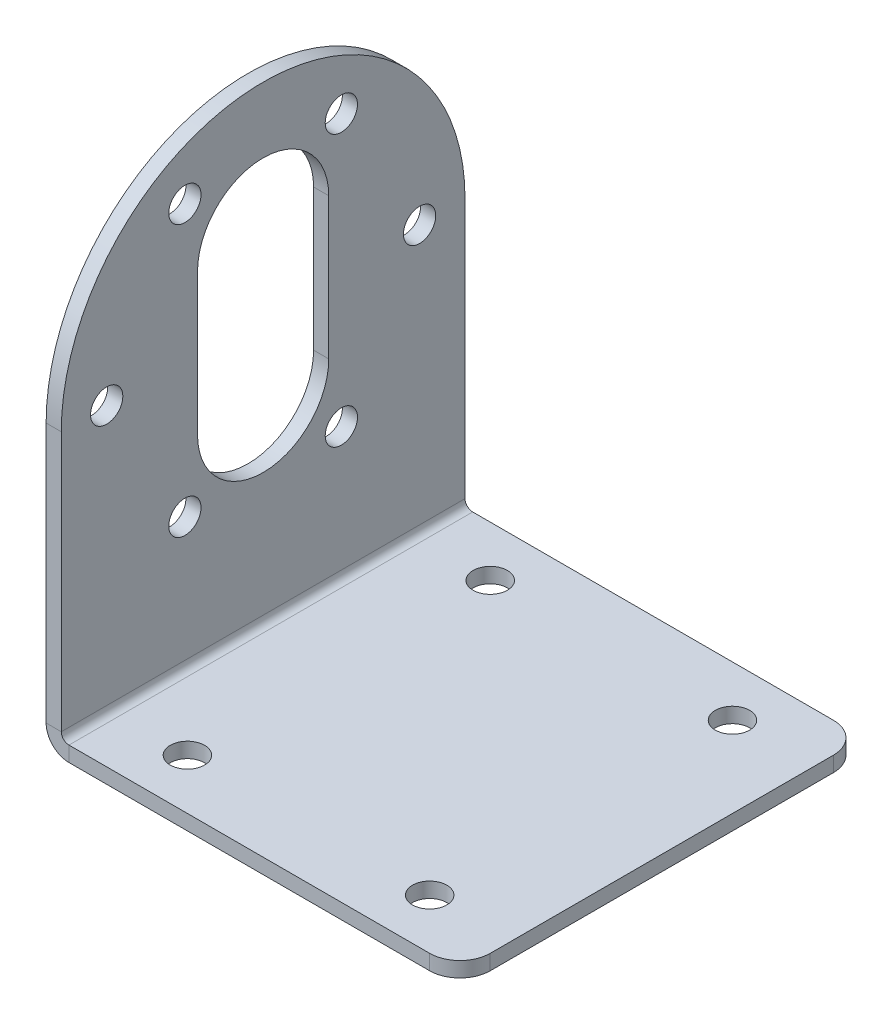
ISO-10303-21;
HEADER;
FILE_DESCRIPTION(('STEP AP214'),'2;1');
FILE_NAME('part.step','',(''),(''),'','','');
FILE_SCHEMA(('AUTOMOTIVE_DESIGN { 1 0 10303 214 1 1 1 1 }'));
ENDSEC;
DATA;
#1=APPLICATION_CONTEXT('core data for automotive mechanical design processes');
#2=APPLICATION_PROTOCOL_DEFINITION('international standard','automotive_design',2000,#1);
#3=PRODUCT_CONTEXT('',#1,'mechanical');
#4=PRODUCT('Part','Part','',(#3));
#5=PRODUCT_RELATED_PRODUCT_CATEGORY('part','',(#4));
#6=PRODUCT_DEFINITION_FORMATION('','',#4);
#7=PRODUCT_DEFINITION_CONTEXT('part definition',#1,'design');
#8=PRODUCT_DEFINITION('design','',#6,#7);
#9=PRODUCT_DEFINITION_SHAPE('','',#8);
#10=(LENGTH_UNIT() NAMED_UNIT(*) SI_UNIT(.MILLI.,.METRE.));
#11=(NAMED_UNIT(*) PLANE_ANGLE_UNIT() SI_UNIT($,.RADIAN.));
#12=(NAMED_UNIT(*) SI_UNIT($,.STERADIAN.) SOLID_ANGLE_UNIT());
#13=UNCERTAINTY_MEASURE_WITH_UNIT(LENGTH_MEASURE(1.E-05),#10,'distance_accuracy_value','');
#14=(GEOMETRIC_REPRESENTATION_CONTEXT(3) GLOBAL_UNCERTAINTY_ASSIGNED_CONTEXT((#13)) GLOBAL_UNIT_ASSIGNED_CONTEXT((#10,
#11,#12)) REPRESENTATION_CONTEXT('',''));
#15=CARTESIAN_POINT('',(0.,0.,0.));
#16=DIRECTION('',(0.,0.,1.));
#17=DIRECTION('',(1.,0.,0.));
#18=AXIS2_PLACEMENT_3D('',#15,#16,#17);
#19=CARTESIAN_POINT('',(0.,0.,0.));
#20=DIRECTION('',(1.,0.,0.));
#21=DIRECTION('',(0.,0.,-1.));
#22=AXIS2_PLACEMENT_3D('',#19,#20,#21);
#23=PLANE('',#22);
#24=DIRECTION('',(0.,-1.,0.));
#25=VECTOR('',#24,1.);
#26=CARTESIAN_POINT('',(0.,7.,-6.5));
#27=LINE('',#26,#25);
#28=CARTESIAN_POINT('',(0.,7.,-6.5));
#29=VERTEX_POINT('',#28);
#30=CARTESIAN_POINT('',(0.,-7.,-6.5));
#31=VERTEX_POINT('',#30);
#32=EDGE_CURVE('E156',#29,#31,#27,.T.);
#33=ORIENTED_EDGE('',*,*,#32,.F.);
#34=CARTESIAN_POINT('',(0.,7.,0.));
#35=DIRECTION('',(-1.,0.,0.));
#36=DIRECTION('',(0.,0.,1.));
#37=AXIS2_PLACEMENT_3D('',#34,#35,#36);
#38=CIRCLE('',#37,6.5);
#39=CARTESIAN_POINT('',(0.,7.,6.5));
#40=VERTEX_POINT('',#39);
#41=EDGE_CURVE('E161',#40,#29,#38,.T.);
#42=ORIENTED_EDGE('',*,*,#41,.F.);
#43=DIRECTION('',(0.,1.,0.));
#44=VECTOR('',#43,1.);
#45=CARTESIAN_POINT('',(0.,7.,6.5));
#46=LINE('',#45,#44);
#47=CARTESIAN_POINT('',(0.,-7.,6.5));
#48=VERTEX_POINT('',#47);
#49=EDGE_CURVE('E165',#48,#40,#46,.T.);
#50=ORIENTED_EDGE('',*,*,#49,.F.);
#51=CARTESIAN_POINT('',(0.,-7.,0.));
#52=DIRECTION('',(-1.,0.,0.));
#53=DIRECTION('',(0.,0.,1.));
#54=AXIS2_PLACEMENT_3D('',#51,#52,#53);
#55=CIRCLE('',#54,6.5);
#56=EDGE_CURVE('E145',#31,#48,#55,.T.);
#57=ORIENTED_EDGE('',*,*,#56,.F.);
#58=EDGE_LOOP('',(#33,#42,#50,#57));
#59=FACE_BOUND('',#58,.T.);
#60=CARTESIAN_POINT('',(0.,-13.4233937586589,7.74999999999988));
#61=DIRECTION('',(-1.,0.,0.));
#62=DIRECTION('',(0.,0.,1.));
#63=AXIS2_PLACEMENT_3D('',#60,#61,#62);
#64=CIRCLE('',#63,1.6);
#65=CARTESIAN_POINT('',(0.,-13.4233937586589,9.34999999999988));
#66=VERTEX_POINT('',#65);
#67=EDGE_CURVE('E180',#66,#66,#64,.T.);
#68=ORIENTED_EDGE('',*,*,#67,.F.);
#69=EDGE_LOOP('',(#68));
#70=FACE_BOUND('',#69,.T.);
#71=CARTESIAN_POINT('',(0.,13.4233937586588,7.75000000000006));
#72=DIRECTION('',(-1.,0.,0.));
#73=DIRECTION('',(0.,0.,1.));
#74=AXIS2_PLACEMENT_3D('',#71,#72,#73);
#75=CIRCLE('',#74,1.6);
#76=CARTESIAN_POINT('',(0.,13.4233937586588,9.35000000000006));
#77=VERTEX_POINT('',#76);
#78=EDGE_CURVE('E192',#77,#77,#75,.T.);
#79=ORIENTED_EDGE('',*,*,#78,.F.);
#80=EDGE_LOOP('',(#79));
#81=FACE_BOUND('',#80,.T.);
#82=CARTESIAN_POINT('',(0.,13.4233937586588,-7.74999999999997));
#83=DIRECTION('',(-1.,0.,0.));
#84=DIRECTION('',(0.,0.,1.));
#85=AXIS2_PLACEMENT_3D('',#82,#83,#84);
#86=CIRCLE('',#85,1.6);
#87=CARTESIAN_POINT('',(0.,13.4233937586588,-6.14999999999997));
#88=VERTEX_POINT('',#87);
#89=EDGE_CURVE('E198',#88,#88,#86,.T.);
#90=ORIENTED_EDGE('',*,*,#89,.F.);
#91=EDGE_LOOP('',(#90));
#92=FACE_BOUND('',#91,.T.);
#93=CARTESIAN_POINT('',(0.,0.,-15.5));
#94=DIRECTION('',(-1.,0.,0.));
#95=DIRECTION('',(0.,0.,1.));
#96=AXIS2_PLACEMENT_3D('',#93,#94,#95);
#97=CIRCLE('',#96,1.6);
#98=CARTESIAN_POINT('',(0.,0.,-13.9));
#99=VERTEX_POINT('',#98);
#100=EDGE_CURVE('E202',#99,#99,#97,.T.);
#101=ORIENTED_EDGE('',*,*,#100,.F.);
#102=EDGE_LOOP('',(#101));
#103=FACE_BOUND('',#102,.T.);
#104=DIRECTION('',(0.,1.,0.));
#105=VECTOR('',#104,1.);
#106=CARTESIAN_POINT('',(0.,0.,-20.));
#107=LINE('',#106,#105);
#108=CARTESIAN_POINT('',(0.,-25.738,-20.));
#109=VERTEX_POINT('',#108);
#110=CARTESIAN_POINT('',(0.,0.,-20.));
#111=VERTEX_POINT('',#110);
#112=EDGE_CURVE('E223',#109,#111,#107,.T.);
#113=ORIENTED_EDGE('',*,*,#112,.F.);
#114=DIRECTION('',(0.,0.,-1.));
#115=VECTOR('',#114,1.);
#116=CARTESIAN_POINT('',(0.,-25.738,0.));
#117=LINE('',#116,#115);
#118=CARTESIAN_POINT('',(0.,-25.738,20.));
#119=VERTEX_POINT('',#118);
#120=EDGE_CURVE('E229',#109,#119,#117,.F.);
#121=ORIENTED_EDGE('',*,*,#120,.T.);
#122=DIRECTION('',(0.,-1.,0.));
#123=VECTOR('',#122,1.);
#124=CARTESIAN_POINT('',(0.,0.,20.));
#125=LINE('',#124,#123);
#126=CARTESIAN_POINT('',(0.,0.,20.));
#127=VERTEX_POINT('',#126);
#128=EDGE_CURVE('E217',#127,#119,#125,.T.);
#129=ORIENTED_EDGE('',*,*,#128,.F.);
#130=CARTESIAN_POINT('',(0.,0.,0.));
#131=DIRECTION('',(1.,0.,0.));
#132=DIRECTION('',(0.,0.,-1.));
#133=AXIS2_PLACEMENT_3D('',#130,#131,#132);
#134=CIRCLE('',#133,20.);
#135=EDGE_CURVE('E220',#111,#127,#134,.T.);
#136=ORIENTED_EDGE('',*,*,#135,.F.);
#137=EDGE_LOOP('',(#113,#121,#129,#136));
#138=FACE_BOUND('',#137,.T.);
#139=CARTESIAN_POINT('',(0.,0.,15.5));
#140=DIRECTION('',(-1.,0.,0.));
#141=DIRECTION('',(0.,0.,1.));
#142=AXIS2_PLACEMENT_3D('',#139,#140,#141);
#143=CIRCLE('',#142,1.6);
#144=CARTESIAN_POINT('',(0.,0.,17.1));
#145=VERTEX_POINT('',#144);
#146=EDGE_CURVE('E186',#145,#145,#143,.T.);
#147=ORIENTED_EDGE('',*,*,#146,.F.);
#148=EDGE_LOOP('',(#147));
#149=FACE_BOUND('',#148,.T.);
#150=CARTESIAN_POINT('',(0.,-13.4233937586587,-7.75000000000016));
#151=DIRECTION('',(-1.,0.,0.));
#152=DIRECTION('',(0.,0.,1.));
#153=AXIS2_PLACEMENT_3D('',#150,#151,#152);
#154=CIRCLE('',#153,1.6);
#155=CARTESIAN_POINT('',(0.,-13.4233937586587,-6.15000000000016));
#156=VERTEX_POINT('',#155);
#157=EDGE_CURVE('E172',#156,#156,#154,.T.);
#158=ORIENTED_EDGE('',*,*,#157,.F.);
#159=EDGE_LOOP('',(#158));
#160=FACE_BOUND('',#159,.T.);
#161=ADVANCED_FACE('F39',(#59,#70,#81,#92,#103,#138,#149,#160),#23,.F.);
#162=CARTESIAN_POINT('',(1.5,-28.,-20.));
#163=DIRECTION('',(0.,0.,-1.));
#164=DIRECTION('',(-1.,0.,0.));
#165=AXIS2_PLACEMENT_3D('',#162,#163,#164);
#166=PLANE('',#165);
#167=DIRECTION('',(1.,0.,0.));
#168=VECTOR('',#167,1.);
#169=CARTESIAN_POINT('',(1.5,-26.5,-20.));
#170=LINE('',#169,#168);
#171=CARTESIAN_POINT('',(38.,-26.5,-20.));
#172=VERTEX_POINT('',#171);
#173=CARTESIAN_POINT('',(2.262,-26.5,-20.));
#174=VERTEX_POINT('',#173);
#175=EDGE_CURVE('E257',#172,#174,#170,.F.);
#176=ORIENTED_EDGE('',*,*,#175,.F.);
#177=DIRECTION('',(0.,1.,0.));
#178=VECTOR('',#177,1.);
#179=CARTESIAN_POINT('',(38.,-28.,-20.));
#180=LINE('',#179,#178);
#181=CARTESIAN_POINT('',(38.,-28.,-20.));
#182=VERTEX_POINT('',#181);
#183=EDGE_CURVE('E286',#172,#182,#180,.F.);
#184=ORIENTED_EDGE('',*,*,#183,.T.);
#185=DIRECTION('',(-1.,0.,0.));
#186=VECTOR('',#185,1.);
#187=CARTESIAN_POINT('',(1.5,-28.,-20.));
#188=LINE('',#187,#186);
#189=CARTESIAN_POINT('',(2.262,-28.,-20.));
#190=VERTEX_POINT('',#189);
#191=EDGE_CURVE('E209',#182,#190,#188,.T.);
#192=ORIENTED_EDGE('',*,*,#191,.T.);
#193=DIRECTION('',(0.,-1.,0.));
#194=VECTOR('',#193,1.);
#195=CARTESIAN_POINT('',(2.262,-28.,-20.));
#196=LINE('',#195,#194);
#197=EDGE_CURVE('E273',#174,#190,#196,.T.);
#198=ORIENTED_EDGE('',*,*,#197,.F.);
#199=EDGE_LOOP('',(#176,#184,#192,#198));
#200=FACE_BOUND('',#199,.T.);
#201=ADVANCED_FACE('F307',(#200),#166,.T.);
#202=CARTESIAN_POINT('',(41.,-28.,20.));
#203=DIRECTION('',(-1.,0.,0.));
#204=DIRECTION('',(0.,0.,1.));
#205=AXIS2_PLACEMENT_3D('',#202,#203,#204);
#206=PLANE('',#205);
#207=DIRECTION('',(0.,0.,1.));
#208=VECTOR('',#207,1.);
#209=CARTESIAN_POINT('',(41.,-28.,20.));
#210=LINE('',#209,#208);
#211=CARTESIAN_POINT('',(41.,-28.,-17.));
#212=VERTEX_POINT('',#211);
#213=CARTESIAN_POINT('',(41.,-28.,17.));
#214=VERTEX_POINT('',#213);
#215=EDGE_CURVE('E211',#212,#214,#210,.T.);
#216=ORIENTED_EDGE('',*,*,#215,.F.);
#217=DIRECTION('',(0.,-1.,0.));
#218=VECTOR('',#217,1.);
#219=CARTESIAN_POINT('',(41.,-28.,-17.));
#220=LINE('',#219,#218);
#221=CARTESIAN_POINT('',(41.,-26.5,-17.));
#222=VERTEX_POINT('',#221);
#223=EDGE_CURVE('E296',#212,#222,#220,.F.);
#224=ORIENTED_EDGE('',*,*,#223,.T.);
#225=DIRECTION('',(0.,0.,1.));
#226=VECTOR('',#225,1.);
#227=CARTESIAN_POINT('',(41.,-26.5,20.));
#228=LINE('',#227,#226);
#229=CARTESIAN_POINT('',(41.,-26.5,17.));
#230=VERTEX_POINT('',#229);
#231=EDGE_CURVE('E259',#222,#230,#228,.T.);
#232=ORIENTED_EDGE('',*,*,#231,.T.);
#233=DIRECTION('',(0.,1.,0.));
#234=VECTOR('',#233,1.);
#235=CARTESIAN_POINT('',(41.,-28.,17.));
#236=LINE('',#235,#234);
#237=EDGE_CURVE('E293',#230,#214,#236,.F.);
#238=ORIENTED_EDGE('',*,*,#237,.T.);
#239=EDGE_LOOP('',(#216,#224,#232,#238));
#240=FACE_BOUND('',#239,.T.);
#241=ADVANCED_FACE('F314',(#240),#206,.F.);
#242=CARTESIAN_POINT('',(1.5,-28.,20.));
#243=DIRECTION('',(0.,0.,-1.));
#244=DIRECTION('',(-1.,0.,0.));
#245=AXIS2_PLACEMENT_3D('',#242,#243,#244);
#246=PLANE('',#245);
#247=DIRECTION('',(-1.,0.,0.));
#248=VECTOR('',#247,1.);
#249=CARTESIAN_POINT('',(1.5,-28.,20.));
#250=LINE('',#249,#248);
#251=CARTESIAN_POINT('',(38.,-28.,20.));
#252=VERTEX_POINT('',#251);
#253=CARTESIAN_POINT('',(2.262,-28.,20.));
#254=VERTEX_POINT('',#253);
#255=EDGE_CURVE('E215',#252,#254,#250,.T.);
#256=ORIENTED_EDGE('',*,*,#255,.F.);
#257=DIRECTION('',(0.,1.,0.));
#258=VECTOR('',#257,1.);
#259=CARTESIAN_POINT('',(38.,-28.,20.));
#260=LINE('',#259,#258);
#261=CARTESIAN_POINT('',(38.,-26.5,20.));
#262=VERTEX_POINT('',#261);
#263=EDGE_CURVE('E11',#252,#262,#260,.T.);
#264=ORIENTED_EDGE('',*,*,#263,.T.);
#265=DIRECTION('',(1.,0.,0.));
#266=VECTOR('',#265,1.);
#267=CARTESIAN_POINT('',(1.5,-26.5,20.));
#268=LINE('',#267,#266);
#269=CARTESIAN_POINT('',(2.262,-26.5,20.));
#270=VERTEX_POINT('',#269);
#271=EDGE_CURVE('E253',#262,#270,#268,.F.);
#272=ORIENTED_EDGE('',*,*,#271,.T.);
#273=DIRECTION('',(0.,-1.,0.));
#274=VECTOR('',#273,1.);
#275=CARTESIAN_POINT('',(2.262,-28.,20.));
#276=LINE('',#275,#274);
#277=EDGE_CURVE('E270',#270,#254,#276,.T.);
#278=ORIENTED_EDGE('',*,*,#277,.T.);
#279=EDGE_LOOP('',(#256,#264,#272,#278));
#280=FACE_BOUND('',#279,.T.);
#281=ADVANCED_FACE('F317',(#280),#246,.F.);
#282=CARTESIAN_POINT('',(2.262,-25.738,20.));
#283=DIRECTION('',(0.,0.,1.));
#284=DIRECTION('',(0.,-1.,0.));
#285=AXIS2_PLACEMENT_3D('',#282,#283,#284);
#286=PLANE('',#285);
#287=ORIENTED_EDGE('',*,*,#277,.F.);
#288=CARTESIAN_POINT('',(2.262,-25.738,20.));
#289=DIRECTION('',(0.,0.,-1.));
#290=DIRECTION('',(-1.,0.,0.));
#291=AXIS2_PLACEMENT_3D('',#288,#289,#290);
#292=CIRCLE('',#291,0.762);
#293=CARTESIAN_POINT('',(1.5,-25.738,20.));
#294=VERTEX_POINT('',#293);
#295=EDGE_CURVE('E254',#270,#294,#292,.T.);
#296=ORIENTED_EDGE('',*,*,#295,.T.);
#297=DIRECTION('',(-1.,0.,0.));
#298=VECTOR('',#297,1.);
#299=CARTESIAN_POINT('',(0.,-25.738,20.));
#300=LINE('',#299,#298);
#301=EDGE_CURVE('E268',#294,#119,#300,.T.);
#302=ORIENTED_EDGE('',*,*,#301,.T.);
#303=CARTESIAN_POINT('',(2.262,-25.738,20.));
#304=DIRECTION('',(0.,0.,-1.));
#305=DIRECTION('',(0.,1.,0.));
#306=AXIS2_PLACEMENT_3D('',#303,#304,#305);
#307=CIRCLE('',#306,2.262);
#308=EDGE_CURVE('E212',#254,#119,#307,.T.);
#309=ORIENTED_EDGE('',*,*,#308,.F.);
#310=EDGE_LOOP('',(#287,#296,#302,#309));
#311=FACE_BOUND('',#310,.T.);
#312=ADVANCED_FACE('F322',(#311),#286,.T.);
#313=CARTESIAN_POINT('',(0.,0.,20.));
#314=DIRECTION('',(0.,0.,1.));
#315=DIRECTION('',(0.,-1.,0.));
#316=AXIS2_PLACEMENT_3D('',#313,#314,#315);
#317=PLANE('',#316);
#318=ORIENTED_EDGE('',*,*,#301,.F.);
#319=DIRECTION('',(0.,1.,0.));
#320=VECTOR('',#319,1.);
#321=CARTESIAN_POINT('',(1.5,0.,20.));
#322=LINE('',#321,#320);
#323=CARTESIAN_POINT('',(1.5,0.,20.));
#324=VERTEX_POINT('',#323);
#325=EDGE_CURVE('E250',#324,#294,#322,.F.);
#326=ORIENTED_EDGE('',*,*,#325,.F.);
#327=DIRECTION('',(-1.,0.,0.));
#328=VECTOR('',#327,1.);
#329=CARTESIAN_POINT('',(0.,0.,20.));
#330=LINE('',#329,#328);
#331=EDGE_CURVE('E266',#324,#127,#330,.T.);
#332=ORIENTED_EDGE('',*,*,#331,.T.);
#333=ORIENTED_EDGE('',*,*,#128,.T.);
#334=EDGE_LOOP('',(#318,#326,#332,#333));
#335=FACE_BOUND('',#334,.T.);
#336=ADVANCED_FACE('F505',(#335),#317,.T.);
#337=CARTESIAN_POINT('',(0.,0.,0.));
#338=DIRECTION('',(1.,0.,0.));
#339=DIRECTION('',(0.,0.,-1.));
#340=AXIS2_PLACEMENT_3D('',#337,#338,#339);
#341=CYLINDRICAL_SURFACE('',#340,20.);
#342=ORIENTED_EDGE('',*,*,#331,.F.);
#343=CARTESIAN_POINT('',(1.5,0.,0.));
#344=DIRECTION('',(1.,0.,0.));
#345=DIRECTION('',(0.,0.,-1.));
#346=AXIS2_PLACEMENT_3D('',#343,#344,#345);
#347=CIRCLE('',#346,20.);
#348=CARTESIAN_POINT('',(1.5,0.,-20.));
#349=VERTEX_POINT('',#348);
#350=EDGE_CURVE('E247',#349,#324,#347,.T.);
#351=ORIENTED_EDGE('',*,*,#350,.F.);
#352=DIRECTION('',(-1.,0.,0.));
#353=VECTOR('',#352,1.);
#354=CARTESIAN_POINT('',(0.,0.,-20.));
#355=LINE('',#354,#353);
#356=EDGE_CURVE('E264',#349,#111,#355,.T.);
#357=ORIENTED_EDGE('',*,*,#356,.T.);
#358=ORIENTED_EDGE('',*,*,#135,.T.);
#359=EDGE_LOOP('',(#342,#351,#357,#358));
#360=FACE_BOUND('',#359,.T.);
#361=ADVANCED_FACE('F497',(#360),#341,.T.);
#362=CARTESIAN_POINT('',(0.,0.,-20.));
#363=DIRECTION('',(0.,0.,-1.));
#364=DIRECTION('',(0.,1.,0.));
#365=AXIS2_PLACEMENT_3D('',#362,#363,#364);
#366=PLANE('',#365);
#367=ORIENTED_EDGE('',*,*,#356,.F.);
#368=DIRECTION('',(0.,1.,0.));
#369=VECTOR('',#368,1.);
#370=CARTESIAN_POINT('',(1.5,0.,-20.));
#371=LINE('',#370,#369);
#372=CARTESIAN_POINT('',(1.5,-25.738,-20.));
#373=VERTEX_POINT('',#372);
#374=EDGE_CURVE('E244',#373,#349,#371,.T.);
#375=ORIENTED_EDGE('',*,*,#374,.F.);
#376=DIRECTION('',(-1.,0.,0.));
#377=VECTOR('',#376,1.);
#378=CARTESIAN_POINT('',(0.,-25.738,-20.));
#379=LINE('',#378,#377);
#380=EDGE_CURVE('E232',#373,#109,#379,.T.);
#381=ORIENTED_EDGE('',*,*,#380,.T.);
#382=ORIENTED_EDGE('',*,*,#112,.T.);
#383=EDGE_LOOP('',(#367,#375,#381,#382));
#384=FACE_BOUND('',#383,.T.);
#385=ADVANCED_FACE('F336',(#384),#366,.T.);
#386=CARTESIAN_POINT('',(2.262,-25.738,-20.));
#387=DIRECTION('',(0.,0.,1.));
#388=DIRECTION('',(0.,-1.,0.));
#389=AXIS2_PLACEMENT_3D('',#386,#387,#388);
#390=PLANE('',#389);
#391=CARTESIAN_POINT('',(2.262,-25.738,-20.));
#392=DIRECTION('',(0.,0.,-1.));
#393=DIRECTION('',(-1.,0.,0.));
#394=AXIS2_PLACEMENT_3D('',#391,#392,#393);
#395=CIRCLE('',#394,0.762);
#396=EDGE_CURVE('E208',#373,#174,#395,.F.);
#397=ORIENTED_EDGE('',*,*,#396,.T.);
#398=ORIENTED_EDGE('',*,*,#197,.T.);
#399=CARTESIAN_POINT('',(2.262,-25.738,-20.));
#400=DIRECTION('',(0.,0.,-1.));
#401=DIRECTION('',(0.,1.,0.));
#402=AXIS2_PLACEMENT_3D('',#399,#400,#401);
#403=CIRCLE('',#402,2.262);
#404=EDGE_CURVE('E233',#109,#190,#403,.F.);
#405=ORIENTED_EDGE('',*,*,#404,.F.);
#406=ORIENTED_EDGE('',*,*,#380,.F.);
#407=EDGE_LOOP('',(#397,#398,#405,#406));
#408=FACE_BOUND('',#407,.T.);
#409=ADVANCED_FACE('F329',(#408),#390,.F.);
#410=CARTESIAN_POINT('',(1.5,-28.,20.));
#411=DIRECTION('',(0.,1.,0.));
#412=DIRECTION('',(0.,0.,1.));
#413=AXIS2_PLACEMENT_3D('',#410,#411,#412);
#414=PLANE('',#413);
#415=CARTESIAN_POINT('',(9.00000000000001,-28.,-15.));
#416=DIRECTION('',(0.,1.,0.));
#417=DIRECTION('',(0.,0.,1.));
#418=AXIS2_PLACEMENT_3D('',#415,#416,#417);
#419=CIRCLE('',#418,1.7);
#420=CARTESIAN_POINT('',(9.00000000000001,-28.,-13.3));
#421=VERTEX_POINT('',#420);
#422=EDGE_CURVE('E448',#421,#421,#419,.T.);
#423=ORIENTED_EDGE('',*,*,#422,.T.);
#424=EDGE_LOOP('',(#423));
#425=FACE_BOUND('',#424,.T.);
#426=CARTESIAN_POINT('',(9.00000000000001,-28.,15.));
#427=DIRECTION('',(0.,1.,0.));
#428=DIRECTION('',(0.,0.,1.));
#429=AXIS2_PLACEMENT_3D('',#426,#427,#428);
#430=CIRCLE('',#429,1.7);
#431=CARTESIAN_POINT('',(9.00000000000001,-28.,16.7));
#432=VERTEX_POINT('',#431);
#433=EDGE_CURVE('E452',#432,#432,#430,.T.);
#434=ORIENTED_EDGE('',*,*,#433,.T.);
#435=EDGE_LOOP('',(#434));
#436=FACE_BOUND('',#435,.T.);
#437=CARTESIAN_POINT('',(33.,-28.,15.));
#438=DIRECTION('',(0.,1.,0.));
#439=DIRECTION('',(0.,0.,1.));
#440=AXIS2_PLACEMENT_3D('',#437,#438,#439);
#441=CIRCLE('',#440,1.7);
#442=CARTESIAN_POINT('',(33.,-28.,16.7));
#443=VERTEX_POINT('',#442);
#444=EDGE_CURVE('E464',#443,#443,#441,.T.);
#445=ORIENTED_EDGE('',*,*,#444,.T.);
#446=EDGE_LOOP('',(#445));
#447=FACE_BOUND('',#446,.T.);
#448=CARTESIAN_POINT('',(33.,-28.,-15.));
#449=DIRECTION('',(0.,1.,0.));
#450=DIRECTION('',(0.,0.,1.));
#451=AXIS2_PLACEMENT_3D('',#448,#449,#450);
#452=CIRCLE('',#451,1.7);
#453=CARTESIAN_POINT('',(33.,-28.,-13.3));
#454=VERTEX_POINT('',#453);
#455=EDGE_CURVE('E470',#454,#454,#452,.T.);
#456=ORIENTED_EDGE('',*,*,#455,.T.);
#457=EDGE_LOOP('',(#456));
#458=FACE_BOUND('',#457,.T.);
#459=ORIENTED_EDGE('',*,*,#191,.F.);
#460=CARTESIAN_POINT('',(38.,-28.,-17.));
#461=DIRECTION('',(0.,1.,0.));
#462=DIRECTION('',(0.,0.,1.));
#463=AXIS2_PLACEMENT_3D('',#460,#461,#462);
#464=CIRCLE('',#463,3.);
#465=EDGE_CURVE('E291',#182,#212,#464,.F.);
#466=ORIENTED_EDGE('',*,*,#465,.T.);
#467=ORIENTED_EDGE('',*,*,#215,.T.);
#468=CARTESIAN_POINT('',(38.,-28.,17.));
#469=DIRECTION('',(0.,1.,0.));
#470=DIRECTION('',(0.,0.,1.));
#471=AXIS2_PLACEMENT_3D('',#468,#469,#470);
#472=CIRCLE('',#471,3.);
#473=EDGE_CURVE('E289',#214,#252,#472,.F.);
#474=ORIENTED_EDGE('',*,*,#473,.T.);
#475=ORIENTED_EDGE('',*,*,#255,.T.);
#476=DIRECTION('',(0.,0.,-1.));
#477=VECTOR('',#476,1.);
#478=CARTESIAN_POINT('',(2.262,-28.,20.));
#479=LINE('',#478,#477);
#480=EDGE_CURVE('E226',#254,#190,#479,.T.);
#481=ORIENTED_EDGE('',*,*,#480,.T.);
#482=EDGE_LOOP('',(#459,#466,#467,#474,#475,#481));
#483=FACE_BOUND('',#482,.T.);
#484=ADVANCED_FACE('F312',(#425,#436,#447,#458,#483),#414,.F.);
#485=CARTESIAN_POINT('',(2.262,-25.738,20.));
#486=DIRECTION('',(0.,0.,-1.));
#487=DIRECTION('',(-1.,0.,0.));
#488=AXIS2_PLACEMENT_3D('',#485,#486,#487);
#489=CYLINDRICAL_SURFACE('',#488,2.262);
#490=ORIENTED_EDGE('',*,*,#308,.T.);
#491=ORIENTED_EDGE('',*,*,#120,.F.);
#492=ORIENTED_EDGE('',*,*,#404,.T.);
#493=ORIENTED_EDGE('',*,*,#480,.F.);
#494=EDGE_LOOP('',(#490,#491,#492,#493));
#495=FACE_BOUND('',#494,.T.);
#496=ADVANCED_FACE('F325',(#495),#489,.T.);
#497=CARTESIAN_POINT('',(1.5,0.,0.));
#498=DIRECTION('',(1.,0.,0.));
#499=DIRECTION('',(0.,0.,-1.));
#500=AXIS2_PLACEMENT_3D('',#497,#498,#499);
#501=PLANE('',#500);
#502=CARTESIAN_POINT('',(1.5,7.,0.));
#503=DIRECTION('',(1.,0.,0.));
#504=DIRECTION('',(0.,0.,-1.));
#505=AXIS2_PLACEMENT_3D('',#502,#503,#504);
#506=CIRCLE('',#505,6.5);
#507=CARTESIAN_POINT('',(1.50000000000002,7.,-6.5));
#508=VERTEX_POINT('',#507);
#509=CARTESIAN_POINT('',(1.50000000000002,7.,6.5));
#510=VERTEX_POINT('',#509);
#511=EDGE_CURVE('E284',#508,#510,#506,.T.);
#512=ORIENTED_EDGE('',*,*,#511,.F.);
#513=DIRECTION('',(0.,1.,0.));
#514=VECTOR('',#513,1.);
#515=CARTESIAN_POINT('',(1.5,0.,-6.5));
#516=LINE('',#515,#514);
#517=CARTESIAN_POINT('',(1.5,-7.,-6.5));
#518=VERTEX_POINT('',#517);
#519=EDGE_CURVE('E276',#518,#508,#516,.T.);
#520=ORIENTED_EDGE('',*,*,#519,.F.);
#521=CARTESIAN_POINT('',(1.5,-7.,0.));
#522=DIRECTION('',(1.,0.,0.));
#523=DIRECTION('',(0.,0.,-1.));
#524=AXIS2_PLACEMENT_3D('',#521,#522,#523);
#525=CIRCLE('',#524,6.5);
#526=CARTESIAN_POINT('',(1.50000000000002,-7.,6.5));
#527=VERTEX_POINT('',#526);
#528=EDGE_CURVE('E148',#527,#518,#525,.T.);
#529=ORIENTED_EDGE('',*,*,#528,.F.);
#530=DIRECTION('',(0.,-1.,0.));
#531=VECTOR('',#530,1.);
#532=CARTESIAN_POINT('',(1.5,0.,6.5));
#533=LINE('',#532,#531);
#534=EDGE_CURVE('E282',#510,#527,#533,.T.);
#535=ORIENTED_EDGE('',*,*,#534,.F.);
#536=EDGE_LOOP('',(#512,#520,#529,#535));
#537=FACE_BOUND('',#536,.T.);
#538=CARTESIAN_POINT('',(1.5,-13.4233937586587,-7.75000000000016));
#539=DIRECTION('',(1.,0.,0.));
#540=DIRECTION('',(0.,0.,-1.));
#541=AXIS2_PLACEMENT_3D('',#538,#539,#540);
#542=CIRCLE('',#541,1.59999999999999);
#543=CARTESIAN_POINT('',(1.5,-13.4233937586587,-9.35000000000015));
#544=VERTEX_POINT('',#543);
#545=EDGE_CURVE('E177',#544,#544,#542,.T.);
#546=ORIENTED_EDGE('',*,*,#545,.F.);
#547=EDGE_LOOP('',(#546));
#548=FACE_BOUND('',#547,.T.);
#549=CARTESIAN_POINT('',(1.5,-13.4233937586589,7.74999999999988));
#550=DIRECTION('',(1.,0.,0.));
#551=DIRECTION('',(0.,0.,-1.));
#552=AXIS2_PLACEMENT_3D('',#549,#550,#551);
#553=CIRCLE('',#552,1.59999999999999);
#554=CARTESIAN_POINT('',(1.5,-13.4233937586589,6.14999999999988));
#555=VERTEX_POINT('',#554);
#556=EDGE_CURVE('E183',#555,#555,#553,.T.);
#557=ORIENTED_EDGE('',*,*,#556,.F.);
#558=EDGE_LOOP('',(#557));
#559=FACE_BOUND('',#558,.T.);
#560=CARTESIAN_POINT('',(1.5,0.,15.5));
#561=DIRECTION('',(1.,0.,0.));
#562=DIRECTION('',(0.,0.,-1.));
#563=AXIS2_PLACEMENT_3D('',#560,#561,#562);
#564=CIRCLE('',#563,1.59999999999999);
#565=CARTESIAN_POINT('',(1.5,0.,13.9));
#566=VERTEX_POINT('',#565);
#567=EDGE_CURVE('E189',#566,#566,#564,.T.);
#568=ORIENTED_EDGE('',*,*,#567,.F.);
#569=EDGE_LOOP('',(#568));
#570=FACE_BOUND('',#569,.T.);
#571=CARTESIAN_POINT('',(1.5,13.4233937586588,7.75000000000006));
#572=DIRECTION('',(1.,0.,0.));
#573=DIRECTION('',(0.,0.,-1.));
#574=AXIS2_PLACEMENT_3D('',#571,#572,#573);
#575=CIRCLE('',#574,1.59999999999999);
#576=CARTESIAN_POINT('',(1.5,13.4233937586588,6.15000000000007));
#577=VERTEX_POINT('',#576);
#578=EDGE_CURVE('E195',#577,#577,#575,.T.);
#579=ORIENTED_EDGE('',*,*,#578,.F.);
#580=EDGE_LOOP('',(#579));
#581=FACE_BOUND('',#580,.T.);
#582=CARTESIAN_POINT('',(1.5,13.4233937586588,-7.74999999999997));
#583=DIRECTION('',(1.,0.,0.));
#584=DIRECTION('',(0.,0.,-1.));
#585=AXIS2_PLACEMENT_3D('',#582,#583,#584);
#586=CIRCLE('',#585,1.59999999999999);
#587=CARTESIAN_POINT('',(1.5,13.4233937586588,-9.34999999999996));
#588=VERTEX_POINT('',#587);
#589=EDGE_CURVE('E201',#588,#588,#586,.T.);
#590=ORIENTED_EDGE('',*,*,#589,.F.);
#591=EDGE_LOOP('',(#590));
#592=FACE_BOUND('',#591,.T.);
#593=CARTESIAN_POINT('',(1.5,0.,-15.5));
#594=DIRECTION('',(1.,0.,0.));
#595=DIRECTION('',(0.,0.,-1.));
#596=AXIS2_PLACEMENT_3D('',#593,#594,#595);
#597=CIRCLE('',#596,1.59999999999999);
#598=CARTESIAN_POINT('',(1.5,0.,-17.1));
#599=VERTEX_POINT('',#598);
#600=EDGE_CURVE('E205',#599,#599,#597,.T.);
#601=ORIENTED_EDGE('',*,*,#600,.F.);
#602=EDGE_LOOP('',(#601));
#603=FACE_BOUND('',#602,.T.);
#604=ORIENTED_EDGE('',*,*,#374,.T.);
#605=ORIENTED_EDGE('',*,*,#350,.T.);
#606=ORIENTED_EDGE('',*,*,#325,.T.);
#607=DIRECTION('',(0.,0.,-1.));
#608=VECTOR('',#607,1.);
#609=CARTESIAN_POINT('',(1.5,-25.738,0.));
#610=LINE('',#609,#608);
#611=EDGE_CURVE('E236',#373,#294,#610,.F.);
#612=ORIENTED_EDGE('',*,*,#611,.F.);
#613=EDGE_LOOP('',(#604,#605,#606,#612));
#614=FACE_BOUND('',#613,.T.);
#615=ADVANCED_FACE('F340',(#537,#548,#559,#570,#581,#592,#603,#614),#501,.T.);
#616=CARTESIAN_POINT('',(1.5,-26.5,20.));
#617=DIRECTION('',(0.,1.,0.));
#618=DIRECTION('',(0.,0.,1.));
#619=AXIS2_PLACEMENT_3D('',#616,#617,#618);
#620=PLANE('',#619);
#621=CARTESIAN_POINT('',(9.00000000000001,-26.5,-15.));
#622=DIRECTION('',(0.,1.,0.));
#623=DIRECTION('',(0.,0.,1.));
#624=AXIS2_PLACEMENT_3D('',#621,#622,#623);
#625=CIRCLE('',#624,1.7);
#626=CARTESIAN_POINT('',(9.00000000000001,-26.5,-13.3));
#627=VERTEX_POINT('',#626);
#628=EDGE_CURVE('E451',#627,#627,#625,.T.);
#629=ORIENTED_EDGE('',*,*,#628,.F.);
#630=EDGE_LOOP('',(#629));
#631=FACE_BOUND('',#630,.T.);
#632=CARTESIAN_POINT('',(9.00000000000001,-26.5,15.));
#633=DIRECTION('',(0.,1.,0.));
#634=DIRECTION('',(0.,0.,1.));
#635=AXIS2_PLACEMENT_3D('',#632,#633,#634);
#636=CIRCLE('',#635,1.7);
#637=CARTESIAN_POINT('',(9.00000000000001,-26.5,16.7));
#638=VERTEX_POINT('',#637);
#639=EDGE_CURVE('E455',#638,#638,#636,.T.);
#640=ORIENTED_EDGE('',*,*,#639,.F.);
#641=EDGE_LOOP('',(#640));
#642=FACE_BOUND('',#641,.T.);
#643=CARTESIAN_POINT('',(33.,-26.5,15.));
#644=DIRECTION('',(0.,1.,0.));
#645=DIRECTION('',(0.,0.,1.));
#646=AXIS2_PLACEMENT_3D('',#643,#644,#645);
#647=CIRCLE('',#646,1.7);
#648=CARTESIAN_POINT('',(33.,-26.5,16.7));
#649=VERTEX_POINT('',#648);
#650=EDGE_CURVE('E461',#649,#649,#647,.T.);
#651=ORIENTED_EDGE('',*,*,#650,.F.);
#652=EDGE_LOOP('',(#651));
#653=FACE_BOUND('',#652,.T.);
#654=CARTESIAN_POINT('',(33.,-26.5,-15.));
#655=DIRECTION('',(0.,1.,0.));
#656=DIRECTION('',(0.,0.,1.));
#657=AXIS2_PLACEMENT_3D('',#654,#655,#656);
#658=CIRCLE('',#657,1.7);
#659=CARTESIAN_POINT('',(33.,-26.5,-13.3));
#660=VERTEX_POINT('',#659);
#661=EDGE_CURVE('E467',#660,#660,#658,.T.);
#662=ORIENTED_EDGE('',*,*,#661,.F.);
#663=EDGE_LOOP('',(#662));
#664=FACE_BOUND('',#663,.T.);
#665=ORIENTED_EDGE('',*,*,#231,.F.);
#666=CARTESIAN_POINT('',(38.,-26.5,-17.));
#667=DIRECTION('',(0.,1.,0.));
#668=DIRECTION('',(0.,0.,1.));
#669=AXIS2_PLACEMENT_3D('',#666,#667,#668);
#670=CIRCLE('',#669,3.);
#671=EDGE_CURVE('E47',#222,#172,#670,.T.);
#672=ORIENTED_EDGE('',*,*,#671,.T.);
#673=ORIENTED_EDGE('',*,*,#175,.T.);
#674=DIRECTION('',(0.,0.,1.));
#675=VECTOR('',#674,1.);
#676=CARTESIAN_POINT('',(2.262,-26.5,20.));
#677=LINE('',#676,#675);
#678=EDGE_CURVE('E241',#270,#174,#677,.F.);
#679=ORIENTED_EDGE('',*,*,#678,.F.);
#680=ORIENTED_EDGE('',*,*,#271,.F.);
#681=CARTESIAN_POINT('',(38.,-26.5,17.));
#682=DIRECTION('',(0.,1.,0.));
#683=DIRECTION('',(0.,0.,1.));
#684=AXIS2_PLACEMENT_3D('',#681,#682,#683);
#685=CIRCLE('',#684,3.);
#686=EDGE_CURVE('E59',#262,#230,#685,.T.);
#687=ORIENTED_EDGE('',*,*,#686,.T.);
#688=EDGE_LOOP('',(#665,#672,#673,#679,#680,#687));
#689=FACE_BOUND('',#688,.T.);
#690=ADVANCED_FACE('F300',(#631,#642,#653,#664,#689),#620,.T.);
#691=CARTESIAN_POINT('',(2.262,-25.738,20.));
#692=DIRECTION('',(0.,0.,-1.));
#693=DIRECTION('',(-1.,0.,0.));
#694=AXIS2_PLACEMENT_3D('',#691,#692,#693);
#695=CYLINDRICAL_SURFACE('',#694,0.762);
#696=ORIENTED_EDGE('',*,*,#295,.F.);
#697=ORIENTED_EDGE('',*,*,#678,.T.);
#698=ORIENTED_EDGE('',*,*,#396,.F.);
#699=ORIENTED_EDGE('',*,*,#611,.T.);
#700=EDGE_LOOP('',(#696,#697,#698,#699));
#701=FACE_BOUND('',#700,.T.);
#702=ADVANCED_FACE('F345',(#701),#695,.F.);
#703=CARTESIAN_POINT('',(0.,0.,-15.5));
#704=DIRECTION('',(-1.,0.,0.));
#705=DIRECTION('',(0.,0.,1.));
#706=AXIS2_PLACEMENT_3D('',#703,#704,#705);
#707=CYLINDRICAL_SURFACE('',#706,1.59999999999999);
#708=ORIENTED_EDGE('',*,*,#600,.T.);
#709=EDGE_LOOP('',(#708));
#710=FACE_BOUND('',#709,.T.);
#711=ORIENTED_EDGE('',*,*,#100,.T.);
#712=EDGE_LOOP('',(#711));
#713=FACE_BOUND('',#712,.T.);
#714=ADVANCED_FACE('F347',(#710,#713),#707,.F.);
#715=CARTESIAN_POINT('',(0.,13.4233937586588,-7.74999999999997));
#716=DIRECTION('',(-1.,0.,0.));
#717=DIRECTION('',(0.,0.,1.));
#718=AXIS2_PLACEMENT_3D('',#715,#716,#717);
#719=CYLINDRICAL_SURFACE('',#718,1.59999999999999);
#720=ORIENTED_EDGE('',*,*,#589,.T.);
#721=EDGE_LOOP('',(#720));
#722=FACE_BOUND('',#721,.T.);
#723=ORIENTED_EDGE('',*,*,#89,.T.);
#724=EDGE_LOOP('',(#723));
#725=FACE_BOUND('',#724,.T.);
#726=ADVANCED_FACE('F353',(#722,#725),#719,.F.);
#727=CARTESIAN_POINT('',(0.,13.4233937586588,7.75000000000006));
#728=DIRECTION('',(-1.,0.,0.));
#729=DIRECTION('',(0.,0.,1.));
#730=AXIS2_PLACEMENT_3D('',#727,#728,#729);
#731=CYLINDRICAL_SURFACE('',#730,1.59999999999999);
#732=ORIENTED_EDGE('',*,*,#578,.T.);
#733=EDGE_LOOP('',(#732));
#734=FACE_BOUND('',#733,.T.);
#735=ORIENTED_EDGE('',*,*,#78,.T.);
#736=EDGE_LOOP('',(#735));
#737=FACE_BOUND('',#736,.T.);
#738=ADVANCED_FACE('F393',(#734,#737),#731,.F.);
#739=CARTESIAN_POINT('',(0.,0.,15.5));
#740=DIRECTION('',(-1.,0.,0.));
#741=DIRECTION('',(0.,0.,1.));
#742=AXIS2_PLACEMENT_3D('',#739,#740,#741);
#743=CYLINDRICAL_SURFACE('',#742,1.59999999999999);
#744=ORIENTED_EDGE('',*,*,#567,.T.);
#745=EDGE_LOOP('',(#744));
#746=FACE_BOUND('',#745,.T.);
#747=ORIENTED_EDGE('',*,*,#146,.T.);
#748=EDGE_LOOP('',(#747));
#749=FACE_BOUND('',#748,.T.);
#750=ADVANCED_FACE('F400',(#746,#749),#743,.F.);
#751=CARTESIAN_POINT('',(0.,-13.4233937586589,7.74999999999988));
#752=DIRECTION('',(-1.,0.,0.));
#753=DIRECTION('',(0.,0.,1.));
#754=AXIS2_PLACEMENT_3D('',#751,#752,#753);
#755=CYLINDRICAL_SURFACE('',#754,1.59999999999999);
#756=ORIENTED_EDGE('',*,*,#556,.T.);
#757=EDGE_LOOP('',(#756));
#758=FACE_BOUND('',#757,.T.);
#759=ORIENTED_EDGE('',*,*,#67,.T.);
#760=EDGE_LOOP('',(#759));
#761=FACE_BOUND('',#760,.T.);
#762=ADVANCED_FACE('F406',(#758,#761),#755,.F.);
#763=CARTESIAN_POINT('',(0.,-13.4233937586587,-7.75000000000016));
#764=DIRECTION('',(-1.,0.,0.));
#765=DIRECTION('',(0.,0.,1.));
#766=AXIS2_PLACEMENT_3D('',#763,#764,#765);
#767=CYLINDRICAL_SURFACE('',#766,1.59999999999999);
#768=ORIENTED_EDGE('',*,*,#545,.T.);
#769=EDGE_LOOP('',(#768));
#770=FACE_BOUND('',#769,.T.);
#771=ORIENTED_EDGE('',*,*,#157,.T.);
#772=EDGE_LOOP('',(#771));
#773=FACE_BOUND('',#772,.T.);
#774=ADVANCED_FACE('F410',(#770,#773),#767,.F.);
#775=CARTESIAN_POINT('',(41.,7.,0.));
#776=DIRECTION('',(-1.,0.,0.));
#777=DIRECTION('',(0.,0.,1.));
#778=AXIS2_PLACEMENT_3D('',#775,#776,#777);
#779=CYLINDRICAL_SURFACE('',#778,6.5);
#780=ORIENTED_EDGE('',*,*,#511,.T.);
#781=DIRECTION('',(-1.,0.,0.));
#782=VECTOR('',#781,1.);
#783=CARTESIAN_POINT('',(41.,7.,6.5));
#784=LINE('',#783,#782);
#785=EDGE_CURVE('E170',#510,#40,#784,.T.);
#786=ORIENTED_EDGE('',*,*,#785,.T.);
#787=ORIENTED_EDGE('',*,*,#41,.T.);
#788=DIRECTION('',(-1.,0.,0.));
#789=VECTOR('',#788,1.);
#790=CARTESIAN_POINT('',(41.,7.,-6.5));
#791=LINE('',#790,#789);
#792=EDGE_CURVE('E152',#508,#29,#791,.T.);
#793=ORIENTED_EDGE('',*,*,#792,.F.);
#794=EDGE_LOOP('',(#780,#786,#787,#793));
#795=FACE_BOUND('',#794,.T.);
#796=ADVANCED_FACE('F414',(#795),#779,.F.);
#797=CARTESIAN_POINT('',(41.,7.,6.5));
#798=DIRECTION('',(0.,0.,1.));
#799=DIRECTION('',(0.,-1.,0.));
#800=AXIS2_PLACEMENT_3D('',#797,#798,#799);
#801=PLANE('',#800);
#802=ORIENTED_EDGE('',*,*,#534,.T.);
#803=DIRECTION('',(-1.,0.,0.));
#804=VECTOR('',#803,1.);
#805=CARTESIAN_POINT('',(41.,-7.,6.5));
#806=LINE('',#805,#804);
#807=EDGE_CURVE('E151',#527,#48,#806,.T.);
#808=ORIENTED_EDGE('',*,*,#807,.T.);
#809=ORIENTED_EDGE('',*,*,#49,.T.);
#810=ORIENTED_EDGE('',*,*,#785,.F.);
#811=EDGE_LOOP('',(#802,#808,#809,#810));
#812=FACE_BOUND('',#811,.T.);
#813=ADVANCED_FACE('F418',(#812),#801,.F.);
#814=CARTESIAN_POINT('',(41.,-7.,0.));
#815=DIRECTION('',(-1.,0.,0.));
#816=DIRECTION('',(0.,0.,1.));
#817=AXIS2_PLACEMENT_3D('',#814,#815,#816);
#818=CYLINDRICAL_SURFACE('',#817,6.5);
#819=ORIENTED_EDGE('',*,*,#528,.T.);
#820=DIRECTION('',(-1.,0.,0.));
#821=VECTOR('',#820,1.);
#822=CARTESIAN_POINT('',(41.,-7.,-6.5));
#823=LINE('',#822,#821);
#824=EDGE_CURVE('E140',#518,#31,#823,.T.);
#825=ORIENTED_EDGE('',*,*,#824,.T.);
#826=ORIENTED_EDGE('',*,*,#56,.T.);
#827=ORIENTED_EDGE('',*,*,#807,.F.);
#828=EDGE_LOOP('',(#819,#825,#826,#827));
#829=FACE_BOUND('',#828,.T.);
#830=ADVANCED_FACE('F142',(#829),#818,.F.);
#831=CARTESIAN_POINT('',(41.,7.,-6.5));
#832=DIRECTION('',(0.,0.,-1.));
#833=DIRECTION('',(0.,1.,0.));
#834=AXIS2_PLACEMENT_3D('',#831,#832,#833);
#835=PLANE('',#834);
#836=ORIENTED_EDGE('',*,*,#519,.T.);
#837=ORIENTED_EDGE('',*,*,#792,.T.);
#838=ORIENTED_EDGE('',*,*,#32,.T.);
#839=ORIENTED_EDGE('',*,*,#824,.F.);
#840=EDGE_LOOP('',(#836,#837,#838,#839));
#841=FACE_BOUND('',#840,.T.);
#842=ADVANCED_FACE('F157',(#841),#835,.F.);
#843=CARTESIAN_POINT('',(33.,-26.5,-15.));
#844=DIRECTION('',(0.,1.,0.));
#845=DIRECTION('',(0.,0.,1.));
#846=AXIS2_PLACEMENT_3D('',#843,#844,#845);
#847=CYLINDRICAL_SURFACE('',#846,1.7);
#848=ORIENTED_EDGE('',*,*,#455,.F.);
#849=EDGE_LOOP('',(#848));
#850=FACE_BOUND('',#849,.T.);
#851=ORIENTED_EDGE('',*,*,#661,.T.);
#852=EDGE_LOOP('',(#851));
#853=FACE_BOUND('',#852,.T.);
#854=ADVANCED_FACE('F422',(#850,#853),#847,.F.);
#855=CARTESIAN_POINT('',(33.,-26.5,15.));
#856=DIRECTION('',(0.,1.,0.));
#857=DIRECTION('',(0.,0.,1.));
#858=AXIS2_PLACEMENT_3D('',#855,#856,#857);
#859=CYLINDRICAL_SURFACE('',#858,1.7);
#860=ORIENTED_EDGE('',*,*,#444,.F.);
#861=EDGE_LOOP('',(#860));
#862=FACE_BOUND('',#861,.T.);
#863=ORIENTED_EDGE('',*,*,#650,.T.);
#864=EDGE_LOOP('',(#863));
#865=FACE_BOUND('',#864,.T.);
#866=ADVANCED_FACE('F430',(#862,#865),#859,.F.);
#867=CARTESIAN_POINT('',(9.00000000000001,-26.5,15.));
#868=DIRECTION('',(0.,1.,0.));
#869=DIRECTION('',(0.,0.,1.));
#870=AXIS2_PLACEMENT_3D('',#867,#868,#869);
#871=CYLINDRICAL_SURFACE('',#870,1.7);
#872=ORIENTED_EDGE('',*,*,#433,.F.);
#873=EDGE_LOOP('',(#872));
#874=FACE_BOUND('',#873,.T.);
#875=ORIENTED_EDGE('',*,*,#639,.T.);
#876=EDGE_LOOP('',(#875));
#877=FACE_BOUND('',#876,.T.);
#878=ADVANCED_FACE('F434',(#874,#877),#871,.F.);
#879=CARTESIAN_POINT('',(9.00000000000001,-26.5,-15.));
#880=DIRECTION('',(0.,1.,0.));
#881=DIRECTION('',(0.,0.,1.));
#882=AXIS2_PLACEMENT_3D('',#879,#880,#881);
#883=CYLINDRICAL_SURFACE('',#882,1.7);
#884=ORIENTED_EDGE('',*,*,#422,.F.);
#885=EDGE_LOOP('',(#884));
#886=FACE_BOUND('',#885,.T.);
#887=ORIENTED_EDGE('',*,*,#628,.T.);
#888=EDGE_LOOP('',(#887));
#889=FACE_BOUND('',#888,.T.);
#890=ADVANCED_FACE('F438',(#886,#889),#883,.F.);
#891=CARTESIAN_POINT('',(38.,-28.,-17.));
#892=DIRECTION('',(0.,1.,0.));
#893=DIRECTION('',(0.,0.,1.));
#894=AXIS2_PLACEMENT_3D('',#891,#892,#893);
#895=CYLINDRICAL_SURFACE('',#894,3.);
#896=ORIENTED_EDGE('',*,*,#671,.F.);
#897=ORIENTED_EDGE('',*,*,#223,.F.);
#898=ORIENTED_EDGE('',*,*,#465,.F.);
#899=ORIENTED_EDGE('',*,*,#183,.F.);
#900=EDGE_LOOP('',(#896,#897,#898,#899));
#901=FACE_BOUND('',#900,.T.);
#902=ADVANCED_FACE('F309',(#901),#895,.T.);
#903=CARTESIAN_POINT('',(38.,-28.,17.));
#904=DIRECTION('',(0.,-1.,0.));
#905=DIRECTION('',(0.,0.,-1.));
#906=AXIS2_PLACEMENT_3D('',#903,#904,#905);
#907=CYLINDRICAL_SURFACE('',#906,3.);
#908=ORIENTED_EDGE('',*,*,#686,.F.);
#909=ORIENTED_EDGE('',*,*,#263,.F.);
#910=ORIENTED_EDGE('',*,*,#473,.F.);
#911=ORIENTED_EDGE('',*,*,#237,.F.);
#912=EDGE_LOOP('',(#908,#909,#910,#911));
#913=FACE_BOUND('',#912,.T.);
#914=ADVANCED_FACE('F41',(#913),#907,.T.);
#915=CLOSED_SHELL('',(#161,#201,#241,#281,#312,#336,#361,#385,#409,#484,#496,#615,#690,#702,
#714,#726,#738,#750,#762,#774,#796,#813,#830,#842,#854,#866,#878,#890,#902,#914));
#916=MANIFOLD_SOLID_BREP('B2',#915);
#917=ADVANCED_BREP_SHAPE_REPRESENTATION('',(#18,#916),#14);
#918=SHAPE_DEFINITION_REPRESENTATION(#9,#917);
ENDSEC;
END-ISO-10303-21;
